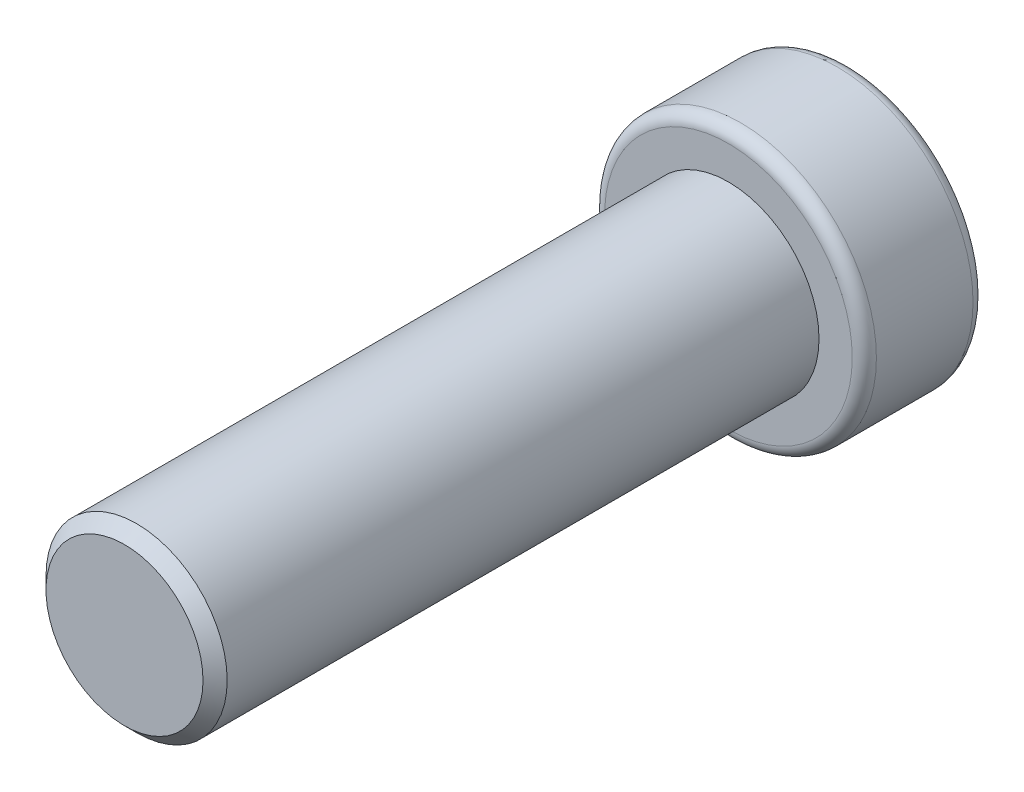
ISO-10303-21;
HEADER;
FILE_DESCRIPTION(('STEP AP214'),'2;1');
FILE_NAME('part.step','',(''),(''),'','','');
FILE_SCHEMA(('AUTOMOTIVE_DESIGN { 1 0 10303 214 1 1 1 1 }'));
ENDSEC;
DATA;
#1=APPLICATION_CONTEXT('core data for automotive mechanical design processes');
#2=APPLICATION_PROTOCOL_DEFINITION('international standard','automotive_design',2000,#1);
#3=PRODUCT_CONTEXT('',#1,'mechanical');
#4=PRODUCT('Part','Part','',(#3));
#5=PRODUCT_RELATED_PRODUCT_CATEGORY('part','',(#4));
#6=PRODUCT_DEFINITION_FORMATION('','',#4);
#7=PRODUCT_DEFINITION_CONTEXT('part definition',#1,'design');
#8=PRODUCT_DEFINITION('design','',#6,#7);
#9=PRODUCT_DEFINITION_SHAPE('','',#8);
#10=(LENGTH_UNIT() NAMED_UNIT(*) SI_UNIT(.MILLI.,.METRE.));
#11=(NAMED_UNIT(*) PLANE_ANGLE_UNIT() SI_UNIT($,.RADIAN.));
#12=(NAMED_UNIT(*) SI_UNIT($,.STERADIAN.) SOLID_ANGLE_UNIT());
#13=UNCERTAINTY_MEASURE_WITH_UNIT(LENGTH_MEASURE(1.E-05),#10,'distance_accuracy_value','');
#14=(GEOMETRIC_REPRESENTATION_CONTEXT(3) GLOBAL_UNCERTAINTY_ASSIGNED_CONTEXT((#13)) GLOBAL_UNIT_ASSIGNED_CONTEXT((#10,
#11,#12)) REPRESENTATION_CONTEXT('',''));
#15=CARTESIAN_POINT('',(0.,0.,0.));
#16=DIRECTION('',(0.,0.,1.));
#17=DIRECTION('',(1.,0.,0.));
#18=AXIS2_PLACEMENT_3D('',#15,#16,#17);
#19=CARTESIAN_POINT('',(1.3,0.,0.));
#20=DIRECTION('',(0.,0.,1.));
#21=DIRECTION('',(1.,0.,0.));
#22=AXIS2_PLACEMENT_3D('',#19,#20,#21);
#23=PLANE('',#22);
#24=CARTESIAN_POINT('',(0.,0.,0.));
#25=DIRECTION('',(0.,0.,1.));
#26=DIRECTION('',(1.,0.,0.));
#27=AXIS2_PLACEMENT_3D('',#24,#25,#26);
#28=CIRCLE('',#27,1.3);
#29=CARTESIAN_POINT('',(1.3,0.,0.));
#30=VERTEX_POINT('',#29);
#31=EDGE_CURVE('E186',#30,#30,#28,.T.);
#32=ORIENTED_EDGE('',*,*,#31,.T.);
#33=EDGE_LOOP('',(#32));
#34=FACE_BOUND('',#33,.T.);
#35=ADVANCED_FACE('F39',(#34),#23,.T.);
#36=CARTESIAN_POINT('',(0.,0.,0.));
#37=DIRECTION('',(0.,0.,-1.));
#38=DIRECTION('',(-1.,0.,0.));
#39=AXIS2_PLACEMENT_3D('',#36,#37,#38);
#40=CONICAL_SURFACE('',#39,1.3,0.785398163397449);
#41=CARTESIAN_POINT('',(0.,0.,-0.2));
#42=DIRECTION('',(0.,0.,1.));
#43=DIRECTION('',(1.,0.,0.));
#44=AXIS2_PLACEMENT_3D('',#41,#42,#43);
#45=CIRCLE('',#44,1.5);
#46=CARTESIAN_POINT('',(1.5,0.,-0.2));
#47=VERTEX_POINT('',#46);
#48=EDGE_CURVE('E182',#47,#47,#45,.T.);
#49=ORIENTED_EDGE('',*,*,#48,.T.);
#50=EDGE_LOOP('',(#49));
#51=FACE_BOUND('',#50,.T.);
#52=ORIENTED_EDGE('',*,*,#31,.F.);
#53=EDGE_LOOP('',(#52));
#54=FACE_BOUND('',#53,.T.);
#55=ADVANCED_FACE('F291',(#51,#54),#40,.T.);
#56=CARTESIAN_POINT('',(0.,0.,0.));
#57=DIRECTION('',(0.,0.,1.));
#58=DIRECTION('',(1.,0.,0.));
#59=AXIS2_PLACEMENT_3D('',#56,#57,#58);
#60=CYLINDRICAL_SURFACE('',#59,1.5);
#61=CARTESIAN_POINT('',(0.,0.,-10.));
#62=DIRECTION('',(0.,0.,1.));
#63=DIRECTION('',(1.,0.,0.));
#64=AXIS2_PLACEMENT_3D('',#61,#62,#63);
#65=CIRCLE('',#64,1.5);
#66=CARTESIAN_POINT('',(1.5,0.,-10.));
#67=VERTEX_POINT('',#66);
#68=EDGE_CURVE('E178',#67,#67,#65,.T.);
#69=ORIENTED_EDGE('',*,*,#68,.T.);
#70=EDGE_LOOP('',(#69));
#71=FACE_BOUND('',#70,.T.);
#72=ORIENTED_EDGE('',*,*,#48,.F.);
#73=EDGE_LOOP('',(#72));
#74=FACE_BOUND('',#73,.T.);
#75=ADVANCED_FACE('F297',(#71,#74),#60,.T.);
#76=CARTESIAN_POINT('',(2.05,0.,-10.));
#77=DIRECTION('',(0.,0.,1.));
#78=DIRECTION('',(1.,0.,0.));
#79=AXIS2_PLACEMENT_3D('',#76,#77,#78);
#80=PLANE('',#79);
#81=CARTESIAN_POINT('',(0.,0.,-10.));
#82=DIRECTION('',(0.,0.,1.));
#83=DIRECTION('',(1.,0.,0.));
#84=AXIS2_PLACEMENT_3D('',#81,#82,#83);
#85=CIRCLE('',#84,2.05);
#86=CARTESIAN_POINT('',(2.05,0.,-10.));
#87=VERTEX_POINT('',#86);
#88=EDGE_CURVE('E174',#87,#87,#85,.T.);
#89=ORIENTED_EDGE('',*,*,#88,.T.);
#90=EDGE_LOOP('',(#89));
#91=FACE_BOUND('',#90,.T.);
#92=ORIENTED_EDGE('',*,*,#68,.F.);
#93=EDGE_LOOP('',(#92));
#94=FACE_BOUND('',#93,.T.);
#95=ADVANCED_FACE('F421',(#91,#94),#80,.T.);
#96=CARTESIAN_POINT('',(0.,0.,-10.2));
#97=DIRECTION('',(0.,0.,1.));
#98=DIRECTION('',(1.,0.,0.));
#99=AXIS2_PLACEMENT_3D('',#96,#97,#98);
#100=TOROIDAL_SURFACE('',#99,2.05,0.2);
#101=CARTESIAN_POINT('',(0.,0.,-10.2));
#102=DIRECTION('',(0.,0.,1.));
#103=DIRECTION('',(1.,0.,0.));
#104=AXIS2_PLACEMENT_3D('',#101,#102,#103);
#105=CIRCLE('',#104,2.25);
#106=CARTESIAN_POINT('',(2.25,0.,-10.2));
#107=VERTEX_POINT('',#106);
#108=EDGE_CURVE('E170',#107,#107,#105,.T.);
#109=ORIENTED_EDGE('',*,*,#108,.T.);
#110=EDGE_LOOP('',(#109));
#111=FACE_BOUND('',#110,.T.);
#112=ORIENTED_EDGE('',*,*,#88,.F.);
#113=EDGE_LOOP('',(#112));
#114=FACE_BOUND('',#113,.T.);
#115=ADVANCED_FACE('F412',(#111,#114),#100,.T.);
#116=CARTESIAN_POINT('',(0.,0.,0.));
#117=DIRECTION('',(0.,0.,1.));
#118=DIRECTION('',(1.,0.,0.));
#119=AXIS2_PLACEMENT_3D('',#116,#117,#118);
#120=CYLINDRICAL_SURFACE('',#119,2.25);
#121=CARTESIAN_POINT('',(0.,0.,-11.8));
#122=DIRECTION('',(0.,0.,1.));
#123=DIRECTION('',(1.,0.,0.));
#124=AXIS2_PLACEMENT_3D('',#121,#122,#123);
#125=CIRCLE('',#124,2.25);
#126=CARTESIAN_POINT('',(2.25,0.,-11.8));
#127=VERTEX_POINT('',#126);
#128=EDGE_CURVE('E166',#127,#127,#125,.T.);
#129=ORIENTED_EDGE('',*,*,#128,.T.);
#130=EDGE_LOOP('',(#129));
#131=FACE_BOUND('',#130,.T.);
#132=ORIENTED_EDGE('',*,*,#108,.F.);
#133=EDGE_LOOP('',(#132));
#134=FACE_BOUND('',#133,.T.);
#135=ADVANCED_FACE('F403',(#131,#134),#120,.T.);
#136=CARTESIAN_POINT('',(0.,0.,-11.8));
#137=DIRECTION('',(0.,0.,1.));
#138=DIRECTION('',(1.,0.,0.));
#139=AXIS2_PLACEMENT_3D('',#136,#137,#138);
#140=TOROIDAL_SURFACE('',#139,2.05,0.2);
#141=CARTESIAN_POINT('',(0.,0.,-12.));
#142=DIRECTION('',(0.,0.,1.));
#143=DIRECTION('',(1.,0.,0.));
#144=AXIS2_PLACEMENT_3D('',#141,#142,#143);
#145=CIRCLE('',#144,2.05);
#146=CARTESIAN_POINT('',(2.05,0.,-12.));
#147=VERTEX_POINT('',#146);
#148=EDGE_CURVE('E152',#147,#147,#145,.T.);
#149=ORIENTED_EDGE('',*,*,#148,.T.);
#150=EDGE_LOOP('',(#149));
#151=FACE_BOUND('',#150,.T.);
#152=ORIENTED_EDGE('',*,*,#128,.F.);
#153=EDGE_LOOP('',(#152));
#154=FACE_BOUND('',#153,.T.);
#155=ADVANCED_FACE('F395',(#151,#154),#140,.T.);
#156=CARTESIAN_POINT('',(0.,0.,-12.));
#157=DIRECTION('',(0.,0.,-1.));
#158=DIRECTION('',(-1.,0.,0.));
#159=AXIS2_PLACEMENT_3D('',#156,#157,#158);
#160=PLANE('',#159);
#161=DIRECTION('',(0.,1.,0.));
#162=VECTOR('',#161,1.);
#163=CARTESIAN_POINT('',(-1.25,-0.721687836487032,-12.));
#164=LINE('',#163,#162);
#165=CARTESIAN_POINT('',(-1.25,-0.721687836487032,-12.));
#166=VERTEX_POINT('',#165);
#167=CARTESIAN_POINT('',(-1.25,0.721687836487032,-12.));
#168=VERTEX_POINT('',#167);
#169=EDGE_CURVE('E128',#166,#168,#164,.T.);
#170=ORIENTED_EDGE('',*,*,#169,.F.);
#171=DIRECTION('',(-0.866025403784438,0.5,0.));
#172=VECTOR('',#171,1.);
#173=CARTESIAN_POINT('',(0.,-1.44337567297406,-12.));
#174=LINE('',#173,#172);
#175=CARTESIAN_POINT('',(0.,-1.44337567297406,-12.));
#176=VERTEX_POINT('',#175);
#177=EDGE_CURVE('E145',#176,#166,#174,.T.);
#178=ORIENTED_EDGE('',*,*,#177,.F.);
#179=DIRECTION('',(-0.866025403784439,-0.5,0.));
#180=VECTOR('',#179,1.);
#181=CARTESIAN_POINT('',(1.25,-0.721687836487032,-12.));
#182=LINE('',#181,#180);
#183=CARTESIAN_POINT('',(1.25,-0.721687836487032,-12.));
#184=VERTEX_POINT('',#183);
#185=EDGE_CURVE('E138',#184,#176,#182,.T.);
#186=ORIENTED_EDGE('',*,*,#185,.F.);
#187=DIRECTION('',(0.,-1.,0.));
#188=VECTOR('',#187,1.);
#189=CARTESIAN_POINT('',(1.25,0.721687836487032,-12.));
#190=LINE('',#189,#188);
#191=CARTESIAN_POINT('',(1.25,0.721687836487032,-12.));
#192=VERTEX_POINT('',#191);
#193=EDGE_CURVE('E134',#192,#184,#190,.T.);
#194=ORIENTED_EDGE('',*,*,#193,.F.);
#195=DIRECTION('',(0.866025403784438,-0.5,0.));
#196=VECTOR('',#195,1.);
#197=CARTESIAN_POINT('',(0.,1.44337567297406,-12.));
#198=LINE('',#197,#196);
#199=CARTESIAN_POINT('',(0.,1.44337567297406,-12.));
#200=VERTEX_POINT('',#199);
#201=EDGE_CURVE('E114',#200,#192,#198,.T.);
#202=ORIENTED_EDGE('',*,*,#201,.F.);
#203=DIRECTION('',(0.866025403784439,0.5,0.));
#204=VECTOR('',#203,1.);
#205=CARTESIAN_POINT('',(-1.25,0.721687836487032,-12.));
#206=LINE('',#205,#204);
#207=EDGE_CURVE('E122',#168,#200,#206,.T.);
#208=ORIENTED_EDGE('',*,*,#207,.F.);
#209=EDGE_LOOP('',(#170,#178,#186,#194,#202,#208));
#210=FACE_BOUND('',#209,.T.);
#211=ORIENTED_EDGE('',*,*,#148,.F.);
#212=EDGE_LOOP('',(#211));
#213=FACE_BOUND('',#212,.T.);
#214=ADVANCED_FACE('F130',(#210,#213),#160,.T.);
#215=CARTESIAN_POINT('',(-1.25,-0.721687836487032,-10.5));
#216=DIRECTION('',(-1.,0.,0.));
#217=DIRECTION('',(0.,0.,1.));
#218=AXIS2_PLACEMENT_3D('',#215,#216,#217);
#219=PLANE('',#218);
#220=DIRECTION('',(0.,0.,-1.));
#221=VECTOR('',#220,1.);
#222=CARTESIAN_POINT('',(-1.25,0.721687836487032,-10.5));
#223=LINE('',#222,#221);
#224=CARTESIAN_POINT('',(-1.25,0.721687836487032,-10.7));
#225=VERTEX_POINT('',#224);
#226=EDGE_CURVE('E119',#225,#168,#223,.T.);
#227=ORIENTED_EDGE('',*,*,#226,.F.);
#228=DIRECTION('',(0.,-1.,0.));
#229=VECTOR('',#228,1.);
#230=CARTESIAN_POINT('',(-1.25,-0.721687836487032,-10.7));
#231=LINE('',#230,#229);
#232=CARTESIAN_POINT('',(-1.25,-0.721687836487032,-10.7));
#233=VERTEX_POINT('',#232);
#234=EDGE_CURVE('E11',#225,#233,#231,.T.);
#235=ORIENTED_EDGE('',*,*,#234,.T.);
#236=DIRECTION('',(0.,0.,-1.));
#237=VECTOR('',#236,1.);
#238=CARTESIAN_POINT('',(-1.25,-0.721687836487032,-10.5));
#239=LINE('',#238,#237);
#240=EDGE_CURVE('E149',#233,#166,#239,.T.);
#241=ORIENTED_EDGE('',*,*,#240,.T.);
#242=ORIENTED_EDGE('',*,*,#169,.T.);
#243=EDGE_LOOP('',(#227,#235,#241,#242));
#244=FACE_BOUND('',#243,.T.);
#245=ADVANCED_FACE('F249',(#244),#219,.F.);
#246=CARTESIAN_POINT('',(0.,-1.44337567297406,-10.5));
#247=DIRECTION('',(-0.5,-0.866025403784438,0.));
#248=DIRECTION('',(0.866025403784439,-0.5,0.));
#249=AXIS2_PLACEMENT_3D('',#246,#247,#248);
#250=PLANE('',#249);
#251=ORIENTED_EDGE('',*,*,#240,.F.);
#252=DIRECTION('',(0.866025403784439,-0.5,0.));
#253=VECTOR('',#252,1.);
#254=CARTESIAN_POINT('',(0.,-1.44337567297406,-10.7));
#255=LINE('',#254,#253);
#256=CARTESIAN_POINT('',(0.,-1.44337567297406,-10.7));
#257=VERTEX_POINT('',#256);
#258=EDGE_CURVE('E209',#233,#257,#255,.T.);
#259=ORIENTED_EDGE('',*,*,#258,.T.);
#260=DIRECTION('',(0.,0.,-1.));
#261=VECTOR('',#260,1.);
#262=CARTESIAN_POINT('',(0.,-1.44337567297406,-10.5));
#263=LINE('',#262,#261);
#264=EDGE_CURVE('E153',#257,#176,#263,.T.);
#265=ORIENTED_EDGE('',*,*,#264,.T.);
#266=ORIENTED_EDGE('',*,*,#177,.T.);
#267=EDGE_LOOP('',(#251,#259,#265,#266));
#268=FACE_BOUND('',#267,.T.);
#269=ADVANCED_FACE('F254',(#268),#250,.F.);
#270=CARTESIAN_POINT('',(1.25,-0.721687836487032,-10.5));
#271=DIRECTION('',(0.5,-0.866025403784438,0.));
#272=DIRECTION('',(0.866025403784439,0.5,0.));
#273=AXIS2_PLACEMENT_3D('',#270,#271,#272);
#274=PLANE('',#273);
#275=ORIENTED_EDGE('',*,*,#264,.F.);
#276=DIRECTION('',(0.866025403784439,0.5,0.));
#277=VECTOR('',#276,1.);
#278=CARTESIAN_POINT('',(1.25,-0.721687836487032,-10.7));
#279=LINE('',#278,#277);
#280=CARTESIAN_POINT('',(1.25,-0.721687836487032,-10.7));
#281=VERTEX_POINT('',#280);
#282=EDGE_CURVE('E213',#257,#281,#279,.T.);
#283=ORIENTED_EDGE('',*,*,#282,.T.);
#284=DIRECTION('',(0.,0.,-1.));
#285=VECTOR('',#284,1.);
#286=CARTESIAN_POINT('',(1.25,-0.721687836487032,-10.5));
#287=LINE('',#286,#285);
#288=EDGE_CURVE('E156',#281,#184,#287,.T.);
#289=ORIENTED_EDGE('',*,*,#288,.T.);
#290=ORIENTED_EDGE('',*,*,#185,.T.);
#291=EDGE_LOOP('',(#275,#283,#289,#290));
#292=FACE_BOUND('',#291,.T.);
#293=ADVANCED_FACE('F258',(#292),#274,.F.);
#294=CARTESIAN_POINT('',(1.25,0.721687836487032,-10.5));
#295=DIRECTION('',(1.,0.,0.));
#296=DIRECTION('',(0.,0.,-1.));
#297=AXIS2_PLACEMENT_3D('',#294,#295,#296);
#298=PLANE('',#297);
#299=ORIENTED_EDGE('',*,*,#288,.F.);
#300=DIRECTION('',(0.,1.,0.));
#301=VECTOR('',#300,1.);
#302=CARTESIAN_POINT('',(1.25,0.721687836487032,-10.7));
#303=LINE('',#302,#301);
#304=CARTESIAN_POINT('',(1.25,0.721687836487032,-10.7));
#305=VERTEX_POINT('',#304);
#306=EDGE_CURVE('E216',#281,#305,#303,.T.);
#307=ORIENTED_EDGE('',*,*,#306,.T.);
#308=DIRECTION('',(0.,0.,-1.));
#309=VECTOR('',#308,1.);
#310=CARTESIAN_POINT('',(1.25,0.721687836487032,-10.5));
#311=LINE('',#310,#309);
#312=EDGE_CURVE('E118',#305,#192,#311,.T.);
#313=ORIENTED_EDGE('',*,*,#312,.T.);
#314=ORIENTED_EDGE('',*,*,#193,.T.);
#315=EDGE_LOOP('',(#299,#307,#313,#314));
#316=FACE_BOUND('',#315,.T.);
#317=ADVANCED_FACE('F262',(#316),#298,.F.);
#318=CARTESIAN_POINT('',(0.,1.44337567297406,-10.5));
#319=DIRECTION('',(0.5,0.866025403784438,0.));
#320=DIRECTION('',(-0.866025403784438,0.5,0.));
#321=AXIS2_PLACEMENT_3D('',#318,#319,#320);
#322=PLANE('',#321);
#323=ORIENTED_EDGE('',*,*,#312,.F.);
#324=DIRECTION('',(-0.866025403784438,0.5,0.));
#325=VECTOR('',#324,1.);
#326=CARTESIAN_POINT('',(0.,1.44337567297406,-10.7));
#327=LINE('',#326,#325);
#328=CARTESIAN_POINT('',(0.,1.44337567297406,-10.7));
#329=VERTEX_POINT('',#328);
#330=EDGE_CURVE('E64',#305,#329,#327,.T.);
#331=ORIENTED_EDGE('',*,*,#330,.T.);
#332=DIRECTION('',(0.,0.,-1.));
#333=VECTOR('',#332,1.);
#334=CARTESIAN_POINT('',(0.,1.44337567297406,-10.5));
#335=LINE('',#334,#333);
#336=EDGE_CURVE('E110',#329,#200,#335,.T.);
#337=ORIENTED_EDGE('',*,*,#336,.T.);
#338=ORIENTED_EDGE('',*,*,#201,.T.);
#339=EDGE_LOOP('',(#323,#331,#337,#338));
#340=FACE_BOUND('',#339,.T.);
#341=ADVANCED_FACE('F112',(#340),#322,.F.);
#342=CARTESIAN_POINT('',(-1.25,0.721687836487032,-10.5));
#343=DIRECTION('',(-0.5,0.866025403784439,0.));
#344=DIRECTION('',(-0.866025403784439,-0.5,0.));
#345=AXIS2_PLACEMENT_3D('',#342,#343,#344);
#346=PLANE('',#345);
#347=ORIENTED_EDGE('',*,*,#336,.F.);
#348=DIRECTION('',(-0.866025403784439,-0.5,0.));
#349=VECTOR('',#348,1.);
#350=CARTESIAN_POINT('',(-1.25,0.721687836487032,-10.7));
#351=LINE('',#350,#349);
#352=EDGE_CURVE('E49',#329,#225,#351,.T.);
#353=ORIENTED_EDGE('',*,*,#352,.T.);
#354=ORIENTED_EDGE('',*,*,#226,.T.);
#355=ORIENTED_EDGE('',*,*,#207,.T.);
#356=EDGE_LOOP('',(#347,#353,#354,#355));
#357=FACE_BOUND('',#356,.T.);
#358=ADVANCED_FACE('F123',(#357),#346,.F.);
#359=CARTESIAN_POINT('',(0.,0.,-10.5));
#360=DIRECTION('',(0.,0.,-1.));
#361=DIRECTION('',(-1.,0.,0.));
#362=AXIS2_PLACEMENT_3D('',#359,#360,#361);
#363=PLANE('',#362);
#364=DIRECTION('',(-0.866025403784439,-0.5,0.));
#365=VECTOR('',#364,1.);
#366=CARTESIAN_POINT('',(0.525000000000001,-0.909326673973662,-10.5));
#367=LINE('',#366,#365);
#368=CARTESIAN_POINT('',(1.05,-0.606217782649108,-10.5));
#369=VERTEX_POINT('',#368);
#370=CARTESIAN_POINT('',(0.,-1.21243556529822,-10.5));
#371=VERTEX_POINT('',#370);
#372=EDGE_CURVE('E202',#369,#371,#367,.T.);
#373=ORIENTED_EDGE('',*,*,#372,.T.);
#374=DIRECTION('',(-0.866025403784438,0.5,0.));
#375=VECTOR('',#374,1.);
#376=CARTESIAN_POINT('',(-0.525000000000001,-0.909326673973662,-10.5));
#377=LINE('',#376,#375);
#378=CARTESIAN_POINT('',(-1.05,-0.606217782649107,-10.5));
#379=VERTEX_POINT('',#378);
#380=EDGE_CURVE('E205',#371,#379,#377,.T.);
#381=ORIENTED_EDGE('',*,*,#380,.T.);
#382=DIRECTION('',(0.,1.,0.));
#383=VECTOR('',#382,1.);
#384=CARTESIAN_POINT('',(-1.05,0.,-10.5));
#385=LINE('',#384,#383);
#386=CARTESIAN_POINT('',(-1.05,0.606217782649108,-10.5));
#387=VERTEX_POINT('',#386);
#388=EDGE_CURVE('E190',#379,#387,#385,.T.);
#389=ORIENTED_EDGE('',*,*,#388,.T.);
#390=DIRECTION('',(0.866025403784439,0.5,0.));
#391=VECTOR('',#390,1.);
#392=CARTESIAN_POINT('',(-0.525000000000001,0.909326673973662,-10.5));
#393=LINE('',#392,#391);
#394=CARTESIAN_POINT('',(0.,1.21243556529822,-10.5));
#395=VERTEX_POINT('',#394);
#396=EDGE_CURVE('E193',#387,#395,#393,.T.);
#397=ORIENTED_EDGE('',*,*,#396,.T.);
#398=DIRECTION('',(0.866025403784438,-0.5,0.));
#399=VECTOR('',#398,1.);
#400=CARTESIAN_POINT('',(0.525000000000001,0.909326673973661,-10.5));
#401=LINE('',#400,#399);
#402=CARTESIAN_POINT('',(1.05,0.606217782649107,-10.5));
#403=VERTEX_POINT('',#402);
#404=EDGE_CURVE('E196',#395,#403,#401,.T.);
#405=ORIENTED_EDGE('',*,*,#404,.T.);
#406=DIRECTION('',(0.,-1.,0.));
#407=VECTOR('',#406,1.);
#408=CARTESIAN_POINT('',(1.05,0.,-10.5));
#409=LINE('',#408,#407);
#410=EDGE_CURVE('E199',#403,#369,#409,.T.);
#411=ORIENTED_EDGE('',*,*,#410,.T.);
#412=EDGE_LOOP('',(#373,#381,#389,#397,#405,#411));
#413=FACE_BOUND('',#412,.T.);
#414=ADVANCED_FACE('F281',(#413),#363,.T.);
#415=CARTESIAN_POINT('',(0.525000000000001,0.909326673973661,-10.5));
#416=DIRECTION('',(0.353553390593272,0.612372435695792,0.707106781186551));
#417=DIRECTION('',(0.866025403784438,-0.5,0.));
#418=AXIS2_PLACEMENT_3D('',#415,#416,#417);
#419=PLANE('',#418);
#420=DIRECTION('',(0.,-0.755928946018457,0.654653670707974));
#421=VECTOR('',#420,1.);
#422=CARTESIAN_POINT('',(0.,1.03923048454133,-10.35));
#423=LINE('',#422,#421);
#424=EDGE_CURVE('E236',#329,#395,#423,.T.);
#425=ORIENTED_EDGE('',*,*,#424,.F.);
#426=ORIENTED_EDGE('',*,*,#330,.F.);
#427=DIRECTION('',(-0.65465367070798,-0.377964473009229,0.654653670707974));
#428=VECTOR('',#427,1.);
#429=CARTESIAN_POINT('',(0.9,0.519615242270662,-10.35));
#430=LINE('',#429,#428);
#431=EDGE_CURVE('E43',#403,#305,#430,.F.);
#432=ORIENTED_EDGE('',*,*,#431,.F.);
#433=ORIENTED_EDGE('',*,*,#404,.F.);
#434=EDGE_LOOP('',(#425,#426,#432,#433));
#435=FACE_BOUND('',#434,.T.);
#436=ADVANCED_FACE('F41',(#435),#419,.F.);
#437=CARTESIAN_POINT('',(1.05,0.,-10.5));
#438=DIRECTION('',(0.707106781186544,0.,0.707106781186551));
#439=DIRECTION('',(0.,-1.,0.));
#440=AXIS2_PLACEMENT_3D('',#437,#438,#439);
#441=PLANE('',#440);
#442=ORIENTED_EDGE('',*,*,#431,.T.);
#443=ORIENTED_EDGE('',*,*,#306,.F.);
#444=DIRECTION('',(-0.65465367070798,0.377964473009228,0.654653670707974));
#445=VECTOR('',#444,1.);
#446=CARTESIAN_POINT('',(0.9,-0.519615242270664,-10.35));
#447=LINE('',#446,#445);
#448=EDGE_CURVE('E233',#369,#281,#447,.F.);
#449=ORIENTED_EDGE('',*,*,#448,.F.);
#450=ORIENTED_EDGE('',*,*,#410,.F.);
#451=EDGE_LOOP('',(#442,#443,#449,#450));
#452=FACE_BOUND('',#451,.T.);
#453=ADVANCED_FACE('F279',(#452),#441,.F.);
#454=CARTESIAN_POINT('',(-0.525000000000001,0.909326673973662,-10.5));
#455=DIRECTION('',(-0.353553390593272,0.612372435695792,0.707106781186551));
#456=DIRECTION('',(0.866025403784439,0.5,0.));
#457=AXIS2_PLACEMENT_3D('',#454,#455,#456);
#458=PLANE('',#457);
#459=ORIENTED_EDGE('',*,*,#424,.T.);
#460=ORIENTED_EDGE('',*,*,#396,.F.);
#461=DIRECTION('',(0.654653670707979,-0.377964473009229,0.654653670707974));
#462=VECTOR('',#461,1.);
#463=CARTESIAN_POINT('',(-0.9,0.519615242270663,-10.35));
#464=LINE('',#463,#462);
#465=EDGE_CURVE('E229',#225,#387,#464,.T.);
#466=ORIENTED_EDGE('',*,*,#465,.F.);
#467=ORIENTED_EDGE('',*,*,#352,.F.);
#468=EDGE_LOOP('',(#459,#460,#466,#467));
#469=FACE_BOUND('',#468,.T.);
#470=ADVANCED_FACE('F265',(#469),#458,.F.);
#471=CARTESIAN_POINT('',(0.525000000000001,-0.909326673973662,-10.5));
#472=DIRECTION('',(0.353553390593273,-0.612372435695792,0.70710678118655));
#473=DIRECTION('',(-0.866025403784439,-0.5,0.));
#474=AXIS2_PLACEMENT_3D('',#471,#472,#473);
#475=PLANE('',#474);
#476=ORIENTED_EDGE('',*,*,#448,.T.);
#477=ORIENTED_EDGE('',*,*,#282,.F.);
#478=DIRECTION('',(0.,0.755928946018457,0.654653670707974));
#479=VECTOR('',#478,1.);
#480=CARTESIAN_POINT('',(0.,-1.03923048454133,-10.35));
#481=LINE('',#480,#479);
#482=EDGE_CURVE('E226',#371,#257,#481,.F.);
#483=ORIENTED_EDGE('',*,*,#482,.F.);
#484=ORIENTED_EDGE('',*,*,#372,.F.);
#485=EDGE_LOOP('',(#476,#477,#483,#484));
#486=FACE_BOUND('',#485,.T.);
#487=ADVANCED_FACE('F277',(#486),#475,.F.);
#488=CARTESIAN_POINT('',(-1.05,0.,-10.5));
#489=DIRECTION('',(-0.707106781186544,0.,0.707106781186551));
#490=DIRECTION('',(0.,1.,0.));
#491=AXIS2_PLACEMENT_3D('',#488,#489,#490);
#492=PLANE('',#491);
#493=ORIENTED_EDGE('',*,*,#465,.T.);
#494=ORIENTED_EDGE('',*,*,#388,.F.);
#495=DIRECTION('',(-0.65465367070798,-0.377964473009229,-0.654653670707974));
#496=VECTOR('',#495,1.);
#497=CARTESIAN_POINT('',(-0.9,-0.519615242270663,-10.35));
#498=LINE('',#497,#496);
#499=EDGE_CURVE('E223',#233,#379,#498,.F.);
#500=ORIENTED_EDGE('',*,*,#499,.F.);
#501=ORIENTED_EDGE('',*,*,#234,.F.);
#502=EDGE_LOOP('',(#493,#494,#500,#501));
#503=FACE_BOUND('',#502,.T.);
#504=ADVANCED_FACE('F270',(#503),#492,.F.);
#505=CARTESIAN_POINT('',(-0.525000000000001,-0.909326673973661,-10.5));
#506=DIRECTION('',(-0.353553390593272,-0.612372435695792,0.707106781186551));
#507=DIRECTION('',(-0.866025403784439,0.5,0.));
#508=AXIS2_PLACEMENT_3D('',#505,#506,#507);
#509=PLANE('',#508);
#510=ORIENTED_EDGE('',*,*,#482,.T.);
#511=ORIENTED_EDGE('',*,*,#258,.F.);
#512=ORIENTED_EDGE('',*,*,#499,.T.);
#513=ORIENTED_EDGE('',*,*,#380,.F.);
#514=EDGE_LOOP('',(#510,#511,#512,#513));
#515=FACE_BOUND('',#514,.T.);
#516=ADVANCED_FACE('F273',(#515),#509,.F.);
#517=CLOSED_SHELL('',(#35,#55,#75,#95,#115,#135,#155,#214,#245,#269,#293,#317,#341,#358,#414,
#436,#453,#470,#487,#504,#516));
#518=MANIFOLD_SOLID_BREP('B2',#517);
#519=ADVANCED_BREP_SHAPE_REPRESENTATION('',(#18,#518),#14);
#520=SHAPE_DEFINITION_REPRESENTATION(#9,#519);
ENDSEC;
END-ISO-10303-21;
